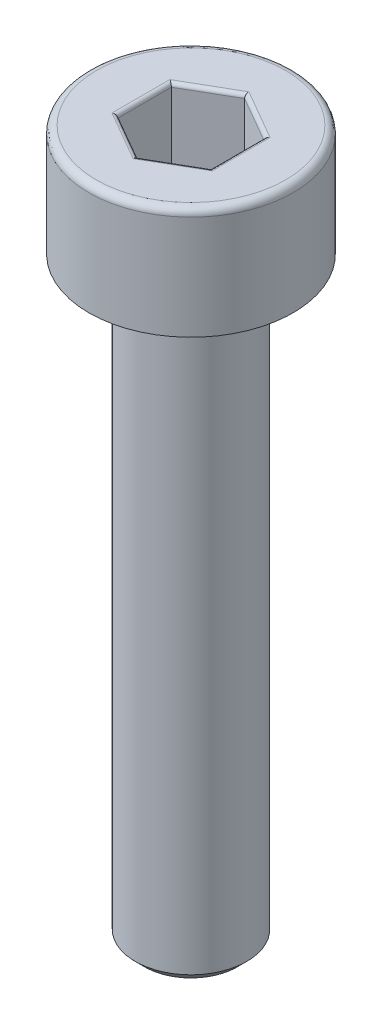
ISO-10303-21;
HEADER;
FILE_DESCRIPTION(('STEP AP214'),'2;1');
FILE_NAME('part.step','',(''),(''),'','','');
FILE_SCHEMA(('AUTOMOTIVE_DESIGN { 1 0 10303 214 1 1 1 1 }'));
ENDSEC;
DATA;
#1=APPLICATION_CONTEXT('core data for automotive mechanical design processes');
#2=APPLICATION_PROTOCOL_DEFINITION('international standard','automotive_design',2000,#1);
#3=PRODUCT_CONTEXT('',#1,'mechanical');
#4=PRODUCT('Part','Part','',(#3));
#5=PRODUCT_RELATED_PRODUCT_CATEGORY('part','',(#4));
#6=PRODUCT_DEFINITION_FORMATION('','',#4);
#7=PRODUCT_DEFINITION_CONTEXT('part definition',#1,'design');
#8=PRODUCT_DEFINITION('design','',#6,#7);
#9=PRODUCT_DEFINITION_SHAPE('','',#8);
#10=(LENGTH_UNIT() NAMED_UNIT(*) SI_UNIT(.MILLI.,.METRE.));
#11=(NAMED_UNIT(*) PLANE_ANGLE_UNIT() SI_UNIT($,.RADIAN.));
#12=(NAMED_UNIT(*) SI_UNIT($,.STERADIAN.) SOLID_ANGLE_UNIT());
#13=UNCERTAINTY_MEASURE_WITH_UNIT(LENGTH_MEASURE(1.E-05),#10,'distance_accuracy_value','');
#14=(GEOMETRIC_REPRESENTATION_CONTEXT(3) GLOBAL_UNCERTAINTY_ASSIGNED_CONTEXT((#13)) GLOBAL_UNIT_ASSIGNED_CONTEXT((#10,
#11,#12)) REPRESENTATION_CONTEXT('',''));
#15=CARTESIAN_POINT('',(0.,0.,0.));
#16=DIRECTION('',(0.,0.,1.));
#17=DIRECTION('',(1.,0.,0.));
#18=AXIS2_PLACEMENT_3D('',#15,#16,#17);
#19=CARTESIAN_POINT('',(0.,-19.,0.));
#20=DIRECTION('',(0.,-1.,0.));
#21=DIRECTION('',(0.,0.,-1.));
#22=AXIS2_PLACEMENT_3D('',#19,#20,#21);
#23=PLANE('',#22);
#24=CARTESIAN_POINT('',(0.,-19.,0.));
#25=DIRECTION('',(0.,-1.,0.));
#26=DIRECTION('',(0.,0.,-1.));
#27=AXIS2_PLACEMENT_3D('',#24,#25,#26);
#28=CIRCLE('',#27,1.25);
#29=CARTESIAN_POINT('',(0.,-19.,-1.25));
#30=VERTEX_POINT('',#29);
#31=EDGE_CURVE('E263',#30,#30,#28,.T.);
#32=ORIENTED_EDGE('',*,*,#31,.T.);
#33=EDGE_LOOP('',(#32));
#34=FACE_BOUND('',#33,.T.);
#35=ADVANCED_FACE('F35',(#34),#23,.T.);
#36=CARTESIAN_POINT('',(0.,0.,0.));
#37=DIRECTION('',(0.,1.,0.));
#38=DIRECTION('',(0.,0.,1.));
#39=AXIS2_PLACEMENT_3D('',#36,#37,#38);
#40=CYLINDRICAL_SURFACE('',#39,1.5);
#41=CARTESIAN_POINT('',(0.,-3.25,0.));
#42=DIRECTION('',(0.,-1.,0.));
#43=DIRECTION('',(0.,0.,-1.));
#44=AXIS2_PLACEMENT_3D('',#41,#42,#43);
#45=CIRCLE('',#44,1.5);
#46=CARTESIAN_POINT('',(0.,-3.25,-1.5));
#47=VERTEX_POINT('',#46);
#48=EDGE_CURVE('E260',#47,#47,#45,.T.);
#49=ORIENTED_EDGE('',*,*,#48,.T.);
#50=EDGE_LOOP('',(#49));
#51=FACE_BOUND('',#50,.T.);
#52=CARTESIAN_POINT('',(0.,-18.75,0.));
#53=DIRECTION('',(0.,-1.,0.));
#54=DIRECTION('',(0.,0.,-1.));
#55=AXIS2_PLACEMENT_3D('',#52,#53,#54);
#56=CIRCLE('',#55,1.5);
#57=CARTESIAN_POINT('',(0.,-18.75,-1.5));
#58=VERTEX_POINT('',#57);
#59=EDGE_CURVE('E257',#58,#58,#56,.F.);
#60=ORIENTED_EDGE('',*,*,#59,.T.);
#61=EDGE_LOOP('',(#60));
#62=FACE_BOUND('',#61,.T.);
#63=ADVANCED_FACE('F289',(#51,#62),#40,.T.);
#64=CARTESIAN_POINT('',(-1.5,-3.,0.));
#65=DIRECTION('',(0.,-1.,0.));
#66=DIRECTION('',(0.,0.,-1.));
#67=AXIS2_PLACEMENT_3D('',#64,#65,#66);
#68=PLANE('',#67);
#69=CARTESIAN_POINT('',(0.,-3.,0.));
#70=DIRECTION('',(0.,-1.,0.));
#71=DIRECTION('',(0.,0.,-1.));
#72=AXIS2_PLACEMENT_3D('',#69,#70,#71);
#73=CIRCLE('',#72,1.75);
#74=CARTESIAN_POINT('',(0.,-3.,-1.75));
#75=VERTEX_POINT('',#74);
#76=EDGE_CURVE('E254',#75,#75,#73,.F.);
#77=ORIENTED_EDGE('',*,*,#76,.T.);
#78=EDGE_LOOP('',(#77));
#79=FACE_BOUND('',#78,.T.);
#80=CARTESIAN_POINT('',(0.,-3.,0.));
#81=DIRECTION('',(0.,1.,0.));
#82=DIRECTION('',(0.,0.,1.));
#83=AXIS2_PLACEMENT_3D('',#80,#81,#82);
#84=CIRCLE('',#83,2.75);
#85=CARTESIAN_POINT('',(0.,-3.,2.75));
#86=VERTEX_POINT('',#85);
#87=EDGE_CURVE('E251',#86,#86,#84,.T.);
#88=ORIENTED_EDGE('',*,*,#87,.F.);
#89=EDGE_LOOP('',(#88));
#90=FACE_BOUND('',#89,.T.);
#91=ADVANCED_FACE('F295',(#79,#90),#68,.T.);
#92=CARTESIAN_POINT('',(0.,0.,0.));
#93=DIRECTION('',(0.,1.,0.));
#94=DIRECTION('',(0.,0.,1.));
#95=AXIS2_PLACEMENT_3D('',#92,#93,#94);
#96=CYLINDRICAL_SURFACE('',#95,2.75);
#97=CARTESIAN_POINT('',(0.,-0.2,0.));
#98=DIRECTION('',(0.,1.,0.));
#99=DIRECTION('',(0.,0.,1.));
#100=AXIS2_PLACEMENT_3D('',#97,#98,#99);
#101=CIRCLE('',#100,2.75);
#102=CARTESIAN_POINT('',(0.,-0.2,2.75));
#103=VERTEX_POINT('',#102);
#104=EDGE_CURVE('E161',#103,#103,#101,.F.);
#105=ORIENTED_EDGE('',*,*,#104,.T.);
#106=EDGE_LOOP('',(#105));
#107=FACE_BOUND('',#106,.T.);
#108=ORIENTED_EDGE('',*,*,#87,.T.);
#109=EDGE_LOOP('',(#108));
#110=FACE_BOUND('',#109,.T.);
#111=ADVANCED_FACE('F305',(#107,#110),#96,.T.);
#112=CARTESIAN_POINT('',(-2.75,0.,0.));
#113=DIRECTION('',(0.,1.,0.));
#114=DIRECTION('',(0.,0.,1.));
#115=AXIS2_PLACEMENT_3D('',#112,#113,#114);
#116=PLANE('',#115);
#117=DIRECTION('',(0.,0.,1.));
#118=VECTOR('',#117,1.);
#119=CARTESIAN_POINT('',(-1.35,0.,-0.721687836487033));
#120=LINE('',#119,#118);
#121=CARTESIAN_POINT('',(-1.35,0.,0.779422863405995));
#122=VERTEX_POINT('',#121);
#123=CARTESIAN_POINT('',(-1.35,0.,-0.779422863405995));
#124=VERTEX_POINT('',#123);
#125=EDGE_CURVE('E177',#122,#124,#120,.F.);
#126=ORIENTED_EDGE('',*,*,#125,.T.);
#127=DIRECTION('',(-0.866025403784439,0.,0.5));
#128=VECTOR('',#127,1.);
#129=CARTESIAN_POINT('',(-0.0500000000000002,0.,-1.52997821335251));
#130=LINE('',#129,#128);
#131=CARTESIAN_POINT('',(0.,0.,-1.55884572681199));
#132=VERTEX_POINT('',#131);
#133=EDGE_CURVE('E136',#124,#132,#130,.F.);
#134=ORIENTED_EDGE('',*,*,#133,.T.);
#135=DIRECTION('',(-0.866025403784439,0.,-0.5));
#136=VECTOR('',#135,1.);
#137=CARTESIAN_POINT('',(1.3,0.,-0.808290376865477));
#138=LINE('',#137,#136);
#139=CARTESIAN_POINT('',(1.35,0.,-0.779422863405995));
#140=VERTEX_POINT('',#139);
#141=EDGE_CURVE('E163',#132,#140,#138,.F.);
#142=ORIENTED_EDGE('',*,*,#141,.T.);
#143=DIRECTION('',(0.,0.,-1.));
#144=VECTOR('',#143,1.);
#145=CARTESIAN_POINT('',(1.35,0.,0.721687836487034));
#146=LINE('',#145,#144);
#147=CARTESIAN_POINT('',(1.35,0.,0.779422863405996));
#148=VERTEX_POINT('',#147);
#149=EDGE_CURVE('E171',#140,#148,#146,.F.);
#150=ORIENTED_EDGE('',*,*,#149,.T.);
#151=DIRECTION('',(0.866025403784439,0.,-0.5));
#152=VECTOR('',#151,1.);
#153=CARTESIAN_POINT('',(0.05,0.,1.52997821335251));
#154=LINE('',#153,#152);
#155=CARTESIAN_POINT('',(0.,0.,1.55884572681199));
#156=VERTEX_POINT('',#155);
#157=EDGE_CURVE('E173',#148,#156,#154,.F.);
#158=ORIENTED_EDGE('',*,*,#157,.T.);
#159=DIRECTION('',(0.866025403784438,0.,0.5));
#160=VECTOR('',#159,1.);
#161=CARTESIAN_POINT('',(-1.3,0.,0.808290376865476));
#162=LINE('',#161,#160);
#163=EDGE_CURVE('E175',#156,#122,#162,.F.);
#164=ORIENTED_EDGE('',*,*,#163,.T.);
#165=EDGE_LOOP('',(#126,#134,#142,#150,#158,#164));
#166=FACE_BOUND('',#165,.T.);
#167=CARTESIAN_POINT('',(0.,0.,0.));
#168=DIRECTION('',(0.,1.,0.));
#169=DIRECTION('',(0.,0.,1.));
#170=AXIS2_PLACEMENT_3D('',#167,#168,#169);
#171=CIRCLE('',#170,2.55);
#172=CARTESIAN_POINT('',(0.,0.,2.55));
#173=VERTEX_POINT('',#172);
#174=EDGE_CURVE('E166',#173,#173,#171,.T.);
#175=ORIENTED_EDGE('',*,*,#174,.T.);
#176=EDGE_LOOP('',(#175));
#177=FACE_BOUND('',#176,.T.);
#178=ADVANCED_FACE('F268',(#166,#177),#116,.T.);
#179=CARTESIAN_POINT('',(0.,-3.,0.));
#180=DIRECTION('',(0.,1.,0.));
#181=DIRECTION('',(0.,0.,1.));
#182=AXIS2_PLACEMENT_3D('',#179,#180,#181);
#183=CONICAL_SURFACE('',#182,1.75,0.785398163397452);
#184=ORIENTED_EDGE('',*,*,#48,.F.);
#185=EDGE_LOOP('',(#184));
#186=FACE_BOUND('',#185,.T.);
#187=ORIENTED_EDGE('',*,*,#76,.F.);
#188=EDGE_LOOP('',(#187));
#189=FACE_BOUND('',#188,.T.);
#190=ADVANCED_FACE('F283',(#186,#189),#183,.T.);
#191=CARTESIAN_POINT('',(0.,-18.75,0.));
#192=DIRECTION('',(0.,1.,0.));
#193=DIRECTION('',(0.,0.,1.));
#194=AXIS2_PLACEMENT_3D('',#191,#192,#193);
#195=CONICAL_SURFACE('',#194,1.5,0.785398163397444);
#196=ORIENTED_EDGE('',*,*,#31,.F.);
#197=EDGE_LOOP('',(#196));
#198=FACE_BOUND('',#197,.T.);
#199=ORIENTED_EDGE('',*,*,#59,.F.);
#200=EDGE_LOOP('',(#199));
#201=FACE_BOUND('',#200,.T.);
#202=ADVANCED_FACE('F273',(#198,#201),#195,.T.);
#203=CARTESIAN_POINT('',(0.,-0.2,0.));
#204=DIRECTION('',(0.,1.,0.));
#205=DIRECTION('',(0.,0.,1.));
#206=AXIS2_PLACEMENT_3D('',#203,#204,#205);
#207=TOROIDAL_SURFACE('',#206,2.55,0.2);
#208=ORIENTED_EDGE('',*,*,#104,.F.);
#209=EDGE_LOOP('',(#208));
#210=FACE_BOUND('',#209,.T.);
#211=ORIENTED_EDGE('',*,*,#174,.F.);
#212=EDGE_LOOP('',(#211));
#213=FACE_BOUND('',#212,.T.);
#214=ADVANCED_FACE('F270',(#210,#213),#207,.T.);
#215=CARTESIAN_POINT('',(1.25,-2.,-0.721687836487033));
#216=DIRECTION('',(0.5,0.,-0.866025403784439));
#217=DIRECTION('',(-0.866025403784439,0.,-0.5));
#218=AXIS2_PLACEMENT_3D('',#215,#216,#217);
#219=PLANE('',#218);
#220=DIRECTION('',(0.,1.,0.));
#221=VECTOR('',#220,1.);
#222=CARTESIAN_POINT('',(1.25,-2.,-0.721687836487033));
#223=LINE('',#222,#221);
#224=CARTESIAN_POINT('',(1.25,-1.9,-0.721687836487033));
#225=VERTEX_POINT('',#224);
#226=CARTESIAN_POINT('',(1.25,-0.1,-0.721687836487033));
#227=VERTEX_POINT('',#226);
#228=EDGE_CURVE('E245',#225,#227,#223,.T.);
#229=ORIENTED_EDGE('',*,*,#228,.T.);
#230=DIRECTION('',(-0.866025403784439,0.,-0.5));
#231=VECTOR('',#230,1.);
#232=CARTESIAN_POINT('',(0.,-0.1,-1.44337567297406));
#233=LINE('',#232,#231);
#234=CARTESIAN_POINT('',(0.,-0.1,-1.44337567297406));
#235=VERTEX_POINT('',#234);
#236=EDGE_CURVE('E197',#227,#235,#233,.T.);
#237=ORIENTED_EDGE('',*,*,#236,.T.);
#238=DIRECTION('',(0.,1.,0.));
#239=VECTOR('',#238,1.);
#240=CARTESIAN_POINT('',(0.,-2.,-1.44337567297406));
#241=LINE('',#240,#239);
#242=CARTESIAN_POINT('',(0.,-1.9,-1.44337567297406));
#243=VERTEX_POINT('',#242);
#244=EDGE_CURVE('E147',#243,#235,#241,.T.);
#245=ORIENTED_EDGE('',*,*,#244,.F.);
#246=DIRECTION('',(-0.866025403784439,0.,-0.5));
#247=VECTOR('',#246,1.);
#248=CARTESIAN_POINT('',(1.25,-1.9,-0.721687836487033));
#249=LINE('',#248,#247);
#250=EDGE_CURVE('E195',#243,#225,#249,.F.);
#251=ORIENTED_EDGE('',*,*,#250,.T.);
#252=EDGE_LOOP('',(#229,#237,#245,#251));
#253=FACE_BOUND('',#252,.T.);
#254=ADVANCED_FACE('F272',(#253),#219,.F.);
#255=CARTESIAN_POINT('',(1.25,-2.,0.721687836487034));
#256=DIRECTION('',(1.,0.,0.));
#257=DIRECTION('',(0.,0.,-1.));
#258=AXIS2_PLACEMENT_3D('',#255,#256,#257);
#259=PLANE('',#258);
#260=DIRECTION('',(0.,1.,0.));
#261=VECTOR('',#260,1.);
#262=CARTESIAN_POINT('',(1.25,-2.,0.721687836487034));
#263=LINE('',#262,#261);
#264=CARTESIAN_POINT('',(1.25,-1.9,0.721687836487034));
#265=VERTEX_POINT('',#264);
#266=CARTESIAN_POINT('',(1.25,-0.1,0.721687836487034));
#267=VERTEX_POINT('',#266);
#268=EDGE_CURVE('E242',#265,#267,#263,.T.);
#269=ORIENTED_EDGE('',*,*,#268,.T.);
#270=DIRECTION('',(0.,0.,-1.));
#271=VECTOR('',#270,1.);
#272=CARTESIAN_POINT('',(1.25,-0.1,-0.721687836487033));
#273=LINE('',#272,#271);
#274=EDGE_CURVE('E193',#267,#227,#273,.T.);
#275=ORIENTED_EDGE('',*,*,#274,.T.);
#276=ORIENTED_EDGE('',*,*,#228,.F.);
#277=DIRECTION('',(0.,0.,-1.));
#278=VECTOR('',#277,1.);
#279=CARTESIAN_POINT('',(1.25,-1.9,0.721687836487034));
#280=LINE('',#279,#278);
#281=EDGE_CURVE('E190',#225,#265,#280,.F.);
#282=ORIENTED_EDGE('',*,*,#281,.T.);
#283=EDGE_LOOP('',(#269,#275,#276,#282));
#284=FACE_BOUND('',#283,.T.);
#285=ADVANCED_FACE('F280',(#284),#259,.F.);
#286=CARTESIAN_POINT('',(0.,-2.,1.44337567297407));
#287=DIRECTION('',(0.5,0.,0.866025403784439));
#288=DIRECTION('',(0.866025403784439,0.,-0.5));
#289=AXIS2_PLACEMENT_3D('',#286,#287,#288);
#290=PLANE('',#289);
#291=DIRECTION('',(0.,1.,0.));
#292=VECTOR('',#291,1.);
#293=CARTESIAN_POINT('',(0.,-2.,1.44337567297407));
#294=LINE('',#293,#292);
#295=CARTESIAN_POINT('',(0.,-1.9,1.44337567297407));
#296=VERTEX_POINT('',#295);
#297=CARTESIAN_POINT('',(0.,-0.1,1.44337567297407));
#298=VERTEX_POINT('',#297);
#299=EDGE_CURVE('E239',#296,#298,#294,.T.);
#300=ORIENTED_EDGE('',*,*,#299,.T.);
#301=DIRECTION('',(0.866025403784439,0.,-0.5));
#302=VECTOR('',#301,1.);
#303=CARTESIAN_POINT('',(1.25,-0.1,0.721687836487034));
#304=LINE('',#303,#302);
#305=EDGE_CURVE('E188',#298,#267,#304,.T.);
#306=ORIENTED_EDGE('',*,*,#305,.T.);
#307=ORIENTED_EDGE('',*,*,#268,.F.);
#308=DIRECTION('',(0.866025403784439,0.,-0.5));
#309=VECTOR('',#308,1.);
#310=CARTESIAN_POINT('',(0.,-1.9,1.44337567297407));
#311=LINE('',#310,#309);
#312=EDGE_CURVE('E186',#265,#296,#311,.F.);
#313=ORIENTED_EDGE('',*,*,#312,.T.);
#314=EDGE_LOOP('',(#300,#306,#307,#313));
#315=FACE_BOUND('',#314,.T.);
#316=ADVANCED_FACE('F329',(#315),#290,.F.);
#317=CARTESIAN_POINT('',(-1.25,-2.,0.721687836487033));
#318=DIRECTION('',(-0.5,0.,0.866025403784439));
#319=DIRECTION('',(0.866025403784438,0.,0.5));
#320=AXIS2_PLACEMENT_3D('',#317,#318,#319);
#321=PLANE('',#320);
#322=DIRECTION('',(0.,1.,0.));
#323=VECTOR('',#322,1.);
#324=CARTESIAN_POINT('',(-1.25,-2.,0.721687836487033));
#325=LINE('',#324,#323);
#326=CARTESIAN_POINT('',(-1.25,-1.9,0.721687836487033));
#327=VERTEX_POINT('',#326);
#328=CARTESIAN_POINT('',(-1.25,-0.1,0.721687836487033));
#329=VERTEX_POINT('',#328);
#330=EDGE_CURVE('E130',#327,#329,#325,.T.);
#331=ORIENTED_EDGE('',*,*,#330,.T.);
#332=DIRECTION('',(0.866025403784438,0.,0.5));
#333=VECTOR('',#332,1.);
#334=CARTESIAN_POINT('',(0.,-0.1,1.44337567297407));
#335=LINE('',#334,#333);
#336=EDGE_CURVE('E184',#329,#298,#335,.T.);
#337=ORIENTED_EDGE('',*,*,#336,.T.);
#338=ORIENTED_EDGE('',*,*,#299,.F.);
#339=DIRECTION('',(0.866025403784438,0.,0.5));
#340=VECTOR('',#339,1.);
#341=CARTESIAN_POINT('',(-1.25,-1.9,0.721687836487033));
#342=LINE('',#341,#340);
#343=EDGE_CURVE('E182',#296,#327,#342,.F.);
#344=ORIENTED_EDGE('',*,*,#343,.T.);
#345=EDGE_LOOP('',(#331,#337,#338,#344));
#346=FACE_BOUND('',#345,.T.);
#347=ADVANCED_FACE('F236',(#346),#321,.F.);
#348=CARTESIAN_POINT('',(-1.25,-2.,-0.721687836487033));
#349=DIRECTION('',(-1.,0.,0.));
#350=DIRECTION('',(0.,0.,1.));
#351=AXIS2_PLACEMENT_3D('',#348,#349,#350);
#352=PLANE('',#351);
#353=DIRECTION('',(0.,1.,0.));
#354=VECTOR('',#353,1.);
#355=CARTESIAN_POINT('',(-1.25,-2.,-0.721687836487033));
#356=LINE('',#355,#354);
#357=CARTESIAN_POINT('',(-1.25,-1.9,-0.721687836487033));
#358=VERTEX_POINT('',#357);
#359=CARTESIAN_POINT('',(-1.25,-0.1,-0.721687836487033));
#360=VERTEX_POINT('',#359);
#361=EDGE_CURVE('E128',#358,#360,#356,.T.);
#362=ORIENTED_EDGE('',*,*,#361,.T.);
#363=DIRECTION('',(0.,0.,1.));
#364=VECTOR('',#363,1.);
#365=CARTESIAN_POINT('',(-1.25,-0.1,0.721687836487033));
#366=LINE('',#365,#364);
#367=EDGE_CURVE('E135',#360,#329,#366,.T.);
#368=ORIENTED_EDGE('',*,*,#367,.T.);
#369=ORIENTED_EDGE('',*,*,#330,.F.);
#370=DIRECTION('',(0.,0.,1.));
#371=VECTOR('',#370,1.);
#372=CARTESIAN_POINT('',(-1.25,-1.9,-0.721687836487033));
#373=LINE('',#372,#371);
#374=EDGE_CURVE('E125',#327,#358,#373,.F.);
#375=ORIENTED_EDGE('',*,*,#374,.T.);
#376=EDGE_LOOP('',(#362,#368,#369,#375));
#377=FACE_BOUND('',#376,.T.);
#378=ADVANCED_FACE('F127',(#377),#352,.F.);
#379=CARTESIAN_POINT('',(0.,-2.,-1.44337567297406));
#380=DIRECTION('',(-0.5,0.,-0.866025403784439));
#381=DIRECTION('',(-0.866025403784439,0.,0.5));
#382=AXIS2_PLACEMENT_3D('',#379,#380,#381);
#383=PLANE('',#382);
#384=ORIENTED_EDGE('',*,*,#244,.T.);
#385=DIRECTION('',(-0.866025403784439,0.,0.5));
#386=VECTOR('',#385,1.);
#387=CARTESIAN_POINT('',(-1.25,-0.1,-0.721687836487032));
#388=LINE('',#387,#386);
#389=EDGE_CURVE('E146',#235,#360,#388,.T.);
#390=ORIENTED_EDGE('',*,*,#389,.T.);
#391=ORIENTED_EDGE('',*,*,#361,.F.);
#392=DIRECTION('',(-0.866025403784439,0.,0.5));
#393=VECTOR('',#392,1.);
#394=CARTESIAN_POINT('',(0.,-1.9,-1.44337567297406));
#395=LINE('',#394,#393);
#396=EDGE_CURVE('E143',#358,#243,#395,.F.);
#397=ORIENTED_EDGE('',*,*,#396,.T.);
#398=EDGE_LOOP('',(#384,#390,#391,#397));
#399=FACE_BOUND('',#398,.T.);
#400=ADVANCED_FACE('F141',(#399),#383,.F.);
#401=CARTESIAN_POINT('',(1.25,-2.,-0.721687836487033));
#402=DIRECTION('',(0.,-1.,0.));
#403=DIRECTION('',(0.,0.,-1.));
#404=AXIS2_PLACEMENT_3D('',#401,#402,#403);
#405=PLANE('',#404);
#406=DIRECTION('',(0.866025403784439,0.,-0.5));
#407=VECTOR('',#406,1.);
#408=CARTESIAN_POINT('',(1.2,-2.,0.63508529610859));
#409=LINE('',#408,#407);
#410=CARTESIAN_POINT('',(0.,-2.,1.32790561913614));
#411=VERTEX_POINT('',#410);
#412=CARTESIAN_POINT('',(1.15,-2.,0.663952809568071));
#413=VERTEX_POINT('',#412);
#414=EDGE_CURVE('E44',#411,#413,#409,.T.);
#415=ORIENTED_EDGE('',*,*,#414,.T.);
#416=DIRECTION('',(0.,0.,-1.));
#417=VECTOR('',#416,1.);
#418=CARTESIAN_POINT('',(1.15,-2.,-0.721687836487033));
#419=LINE('',#418,#417);
#420=CARTESIAN_POINT('',(1.15,-2.,-0.66395280956807));
#421=VERTEX_POINT('',#420);
#422=EDGE_CURVE('E11',#413,#421,#419,.T.);
#423=ORIENTED_EDGE('',*,*,#422,.T.);
#424=DIRECTION('',(-0.866025403784439,0.,-0.5));
#425=VECTOR('',#424,1.);
#426=CARTESIAN_POINT('',(-0.0500000000000001,-2.,-1.35677313259562));
#427=LINE('',#426,#425);
#428=CARTESIAN_POINT('',(0.,-2.,-1.32790561913614));
#429=VERTEX_POINT('',#428);
#430=EDGE_CURVE('E199',#421,#429,#427,.T.);
#431=ORIENTED_EDGE('',*,*,#430,.T.);
#432=DIRECTION('',(-0.866025403784439,0.,0.5));
#433=VECTOR('',#432,1.);
#434=CARTESIAN_POINT('',(-1.2,-2.,-0.635085296108588));
#435=LINE('',#434,#433);
#436=CARTESIAN_POINT('',(-1.15,-2.,-0.66395280956807));
#437=VERTEX_POINT('',#436);
#438=EDGE_CURVE('E201',#429,#437,#435,.T.);
#439=ORIENTED_EDGE('',*,*,#438,.T.);
#440=DIRECTION('',(0.,0.,1.));
#441=VECTOR('',#440,1.);
#442=CARTESIAN_POINT('',(-1.15,-2.,0.721687836487033));
#443=LINE('',#442,#441);
#444=CARTESIAN_POINT('',(-1.15,-2.,0.66395280956807));
#445=VERTEX_POINT('',#444);
#446=EDGE_CURVE('E152',#437,#445,#443,.T.);
#447=ORIENTED_EDGE('',*,*,#446,.T.);
#448=DIRECTION('',(0.866025403784438,0.,0.5));
#449=VECTOR('',#448,1.);
#450=CARTESIAN_POINT('',(0.0499999999999999,-2.,1.35677313259562));
#451=LINE('',#450,#449);
#452=EDGE_CURVE('E55',#445,#411,#451,.T.);
#453=ORIENTED_EDGE('',*,*,#452,.T.);
#454=EDGE_LOOP('',(#415,#423,#431,#439,#447,#453));
#455=FACE_BOUND('',#454,.T.);
#456=ADVANCED_FACE('F324',(#455),#405,.F.);
#457=CARTESIAN_POINT('',(0.05,-0.1,1.52997821335251));
#458=DIRECTION('',(-0.866025403784439,0.,0.5));
#459=DIRECTION('',(0.5,0.,0.866025403784439));
#460=AXIS2_PLACEMENT_3D('',#457,#458,#459);
#461=CYLINDRICAL_SURFACE('',#460,0.1);
#462=CARTESIAN_POINT('',(0.,-0.1,1.55884572681199));
#463=DIRECTION('',(-1.,0.,0.));
#464=DIRECTION('',(0.,0.,-1.));
#465=AXIS2_PLACEMENT_3D('',#462,#463,#464);
#466=ELLIPSE('',#465,0.115470053837925,0.1);
#467=EDGE_CURVE('E216',#156,#298,#466,.T.);
#468=ORIENTED_EDGE('',*,*,#467,.F.);
#469=ORIENTED_EDGE('',*,*,#157,.F.);
#470=CARTESIAN_POINT('',(1.35,-0.1,0.779422863405997));
#471=DIRECTION('',(-0.5,0.,0.866025403784438));
#472=DIRECTION('',(-0.866025403784438,0.,-0.5));
#473=AXIS2_PLACEMENT_3D('',#470,#471,#472);
#474=ELLIPSE('',#473,0.115470053837925,0.1);
#475=EDGE_CURVE('E219',#267,#148,#474,.F.);
#476=ORIENTED_EDGE('',*,*,#475,.F.);
#477=ORIENTED_EDGE('',*,*,#305,.F.);
#478=EDGE_LOOP('',(#468,#469,#476,#477));
#479=FACE_BOUND('',#478,.T.);
#480=ADVANCED_FACE('F336',(#479),#461,.T.);
#481=CARTESIAN_POINT('',(1.35,-0.1,0.721687836487034));
#482=DIRECTION('',(0.,0.,1.));
#483=DIRECTION('',(1.,0.,0.));
#484=AXIS2_PLACEMENT_3D('',#481,#482,#483);
#485=CYLINDRICAL_SURFACE('',#484,0.1);
#486=ORIENTED_EDGE('',*,*,#475,.T.);
#487=ORIENTED_EDGE('',*,*,#149,.F.);
#488=CARTESIAN_POINT('',(1.35,-0.1,-0.779422863405995));
#489=DIRECTION('',(0.5,0.,0.866025403784439));
#490=DIRECTION('',(-0.866025403784439,0.,0.5));
#491=AXIS2_PLACEMENT_3D('',#488,#489,#490);
#492=ELLIPSE('',#491,0.115470053837925,0.1);
#493=EDGE_CURVE('E213',#227,#140,#492,.F.);
#494=ORIENTED_EDGE('',*,*,#493,.F.);
#495=ORIENTED_EDGE('',*,*,#274,.F.);
#496=EDGE_LOOP('',(#486,#487,#494,#495));
#497=FACE_BOUND('',#496,.T.);
#498=ADVANCED_FACE('F340',(#497),#485,.T.);
#499=CARTESIAN_POINT('',(-1.3,-0.1,0.808290376865476));
#500=DIRECTION('',(-0.866025403784438,0.,-0.5));
#501=DIRECTION('',(-0.5,0.,0.866025403784439));
#502=AXIS2_PLACEMENT_3D('',#499,#500,#501);
#503=CYLINDRICAL_SURFACE('',#502,0.1);
#504=ORIENTED_EDGE('',*,*,#467,.T.);
#505=ORIENTED_EDGE('',*,*,#336,.F.);
#506=CARTESIAN_POINT('',(-1.35,-0.1,0.779422863405995));
#507=DIRECTION('',(-0.5,0.,-0.866025403784439));
#508=DIRECTION('',(0.866025403784439,0.,-0.5));
#509=AXIS2_PLACEMENT_3D('',#506,#507,#508);
#510=ELLIPSE('',#509,0.115470053837925,0.1);
#511=EDGE_CURVE('E210',#122,#329,#510,.T.);
#512=ORIENTED_EDGE('',*,*,#511,.F.);
#513=ORIENTED_EDGE('',*,*,#163,.F.);
#514=EDGE_LOOP('',(#504,#505,#512,#513));
#515=FACE_BOUND('',#514,.T.);
#516=ADVANCED_FACE('F346',(#515),#503,.T.);
#517=CARTESIAN_POINT('',(1.3,-0.1,-0.808290376865477));
#518=DIRECTION('',(0.866025403784439,0.,0.5));
#519=DIRECTION('',(0.5,0.,-0.866025403784439));
#520=AXIS2_PLACEMENT_3D('',#517,#518,#519);
#521=CYLINDRICAL_SURFACE('',#520,0.1);
#522=ORIENTED_EDGE('',*,*,#493,.T.);
#523=ORIENTED_EDGE('',*,*,#141,.F.);
#524=CARTESIAN_POINT('',(0.,-0.1,-1.55884572681199));
#525=DIRECTION('',(1.,0.,0.));
#526=DIRECTION('',(0.,0.,-1.));
#527=AXIS2_PLACEMENT_3D('',#524,#525,#526);
#528=ELLIPSE('',#527,0.115470053837925,0.1);
#529=EDGE_CURVE('E208',#235,#132,#528,.F.);
#530=ORIENTED_EDGE('',*,*,#529,.F.);
#531=ORIENTED_EDGE('',*,*,#236,.F.);
#532=EDGE_LOOP('',(#522,#523,#530,#531));
#533=FACE_BOUND('',#532,.T.);
#534=ADVANCED_FACE('F376',(#533),#521,.T.);
#535=CARTESIAN_POINT('',(-1.35,-0.1,-0.721687836487033));
#536=DIRECTION('',(0.,0.,-1.));
#537=DIRECTION('',(-1.,0.,0.));
#538=AXIS2_PLACEMENT_3D('',#535,#536,#537);
#539=CYLINDRICAL_SURFACE('',#538,0.1);
#540=ORIENTED_EDGE('',*,*,#511,.T.);
#541=ORIENTED_EDGE('',*,*,#367,.F.);
#542=CARTESIAN_POINT('',(-1.35,-0.1,-0.779422863405995));
#543=DIRECTION('',(0.5,0.,-0.866025403784439));
#544=DIRECTION('',(0.866025403784439,0.,0.5));
#545=AXIS2_PLACEMENT_3D('',#542,#543,#544);
#546=ELLIPSE('',#545,0.115470053837925,0.1);
#547=EDGE_CURVE('E206',#124,#360,#546,.T.);
#548=ORIENTED_EDGE('',*,*,#547,.F.);
#549=ORIENTED_EDGE('',*,*,#125,.F.);
#550=EDGE_LOOP('',(#540,#541,#548,#549));
#551=FACE_BOUND('',#550,.T.);
#552=ADVANCED_FACE('F371',(#551),#539,.T.);
#553=CARTESIAN_POINT('',(-0.05,-0.1,-1.52997821335251));
#554=DIRECTION('',(0.866025403784439,0.,-0.5));
#555=DIRECTION('',(-0.5,0.,-0.866025403784439));
#556=AXIS2_PLACEMENT_3D('',#553,#554,#555);
#557=CYLINDRICAL_SURFACE('',#556,0.1);
#558=ORIENTED_EDGE('',*,*,#529,.T.);
#559=ORIENTED_EDGE('',*,*,#133,.F.);
#560=ORIENTED_EDGE('',*,*,#547,.T.);
#561=ORIENTED_EDGE('',*,*,#389,.F.);
#562=EDGE_LOOP('',(#558,#559,#560,#561));
#563=FACE_BOUND('',#562,.T.);
#564=ADVANCED_FACE('F367',(#563),#557,.T.);
#565=CARTESIAN_POINT('',(-1.15,-1.9,-0.721687836487033));
#566=DIRECTION('',(0.,0.,-1.));
#567=DIRECTION('',(-1.,0.,0.));
#568=AXIS2_PLACEMENT_3D('',#565,#566,#567);
#569=CYLINDRICAL_SURFACE('',#568,0.1);
#570=CARTESIAN_POINT('',(-1.15,-1.9,-0.663952809568069));
#571=DIRECTION('',(0.5,0.,-0.866025403784439));
#572=DIRECTION('',(-0.866025403784439,0.,-0.5));
#573=AXIS2_PLACEMENT_3D('',#570,#571,#572);
#574=ELLIPSE('',#573,0.115470053837925,0.1);
#575=EDGE_CURVE('E151',#358,#437,#574,.F.);
#576=ORIENTED_EDGE('',*,*,#575,.F.);
#577=ORIENTED_EDGE('',*,*,#374,.F.);
#578=CARTESIAN_POINT('',(-1.15,-1.9,0.66395280956807));
#579=DIRECTION('',(-0.5,0.,-0.866025403784439));
#580=DIRECTION('',(-0.866025403784439,0.,0.5));
#581=AXIS2_PLACEMENT_3D('',#578,#579,#580);
#582=ELLIPSE('',#581,0.115470053837925,0.1);
#583=EDGE_CURVE('E39',#445,#327,#582,.T.);
#584=ORIENTED_EDGE('',*,*,#583,.F.);
#585=ORIENTED_EDGE('',*,*,#446,.F.);
#586=EDGE_LOOP('',(#576,#577,#584,#585));
#587=FACE_BOUND('',#586,.T.);
#588=ADVANCED_FACE('F37',(#587),#569,.F.);
#589=CARTESIAN_POINT('',(0.0499999999999988,-1.9,1.35677313259562));
#590=DIRECTION('',(-0.866025403784438,0.,-0.5));
#591=DIRECTION('',(-0.5,0.,0.866025403784439));
#592=AXIS2_PLACEMENT_3D('',#589,#590,#591);
#593=CYLINDRICAL_SURFACE('',#592,0.1);
#594=ORIENTED_EDGE('',*,*,#583,.T.);
#595=ORIENTED_EDGE('',*,*,#343,.F.);
#596=CARTESIAN_POINT('',(0.,-1.9,1.32790561913614));
#597=DIRECTION('',(-1.,0.,0.));
#598=DIRECTION('',(0.,0.,1.));
#599=AXIS2_PLACEMENT_3D('',#596,#597,#598);
#600=ELLIPSE('',#599,0.115470053837925,0.1);
#601=EDGE_CURVE('E155',#411,#296,#600,.T.);
#602=ORIENTED_EDGE('',*,*,#601,.F.);
#603=ORIENTED_EDGE('',*,*,#452,.F.);
#604=EDGE_LOOP('',(#594,#595,#602,#603));
#605=FACE_BOUND('',#604,.T.);
#606=ADVANCED_FACE('F233',(#605),#593,.F.);
#607=CARTESIAN_POINT('',(0.675,-1.9,-1.71761705083914));
#608=DIRECTION('',(0.866025403784439,0.,-0.5));
#609=DIRECTION('',(-0.5,0.,-0.866025403784439));
#610=AXIS2_PLACEMENT_3D('',#607,#608,#609);
#611=CYLINDRICAL_SURFACE('',#610,0.1);
#612=ORIENTED_EDGE('',*,*,#575,.T.);
#613=ORIENTED_EDGE('',*,*,#438,.F.);
#614=CARTESIAN_POINT('',(0.,-1.9,-1.32790561913614));
#615=DIRECTION('',(1.,0.,0.));
#616=DIRECTION('',(0.,0.,-1.));
#617=AXIS2_PLACEMENT_3D('',#614,#615,#616);
#618=ELLIPSE('',#617,0.115470053837925,0.1);
#619=EDGE_CURVE('E159',#243,#429,#618,.F.);
#620=ORIENTED_EDGE('',*,*,#619,.F.);
#621=ORIENTED_EDGE('',*,*,#396,.F.);
#622=EDGE_LOOP('',(#612,#613,#620,#621));
#623=FACE_BOUND('',#622,.T.);
#624=ADVANCED_FACE('F157',(#623),#611,.F.);
#625=CARTESIAN_POINT('',(1.825,-1.9,0.274241377865074));
#626=DIRECTION('',(-0.866025403784439,0.,0.5));
#627=DIRECTION('',(0.5,0.,0.866025403784439));
#628=AXIS2_PLACEMENT_3D('',#625,#626,#627);
#629=CYLINDRICAL_SURFACE('',#628,0.1);
#630=ORIENTED_EDGE('',*,*,#601,.T.);
#631=ORIENTED_EDGE('',*,*,#312,.F.);
#632=CARTESIAN_POINT('',(1.15,-1.9,0.663952809568072));
#633=DIRECTION('',(-0.5,0.,0.866025403784438));
#634=DIRECTION('',(0.866025403784438,0.,0.5));
#635=AXIS2_PLACEMENT_3D('',#632,#633,#634);
#636=ELLIPSE('',#635,0.115470053837925,0.1);
#637=EDGE_CURVE('E224',#413,#265,#636,.T.);
#638=ORIENTED_EDGE('',*,*,#637,.F.);
#639=ORIENTED_EDGE('',*,*,#414,.F.);
#640=EDGE_LOOP('',(#630,#631,#638,#639));
#641=FACE_BOUND('',#640,.T.);
#642=ADVANCED_FACE('F230',(#641),#629,.F.);
#643=CARTESIAN_POINT('',(1.2,-1.9,-0.635085296108589));
#644=DIRECTION('',(0.866025403784439,0.,0.5));
#645=DIRECTION('',(0.5,0.,-0.866025403784439));
#646=AXIS2_PLACEMENT_3D('',#643,#644,#645);
#647=CYLINDRICAL_SURFACE('',#646,0.1);
#648=ORIENTED_EDGE('',*,*,#619,.T.);
#649=ORIENTED_EDGE('',*,*,#430,.F.);
#650=CARTESIAN_POINT('',(1.15,-1.9,-0.66395280956807));
#651=DIRECTION('',(0.5,0.,0.866025403784439));
#652=DIRECTION('',(-0.866025403784439,0.,0.5));
#653=AXIS2_PLACEMENT_3D('',#650,#651,#652);
#654=ELLIPSE('',#653,0.115470053837925,0.1);
#655=EDGE_CURVE('E222',#225,#421,#654,.F.);
#656=ORIENTED_EDGE('',*,*,#655,.F.);
#657=ORIENTED_EDGE('',*,*,#250,.F.);
#658=EDGE_LOOP('',(#648,#649,#656,#657));
#659=FACE_BOUND('',#658,.T.);
#660=ADVANCED_FACE('F355',(#659),#647,.F.);
#661=CARTESIAN_POINT('',(1.15,-1.9,-0.721687836487033));
#662=DIRECTION('',(0.,0.,1.));
#663=DIRECTION('',(1.,0.,0.));
#664=AXIS2_PLACEMENT_3D('',#661,#662,#663);
#665=CYLINDRICAL_SURFACE('',#664,0.1);
#666=ORIENTED_EDGE('',*,*,#637,.T.);
#667=ORIENTED_EDGE('',*,*,#281,.F.);
#668=ORIENTED_EDGE('',*,*,#655,.T.);
#669=ORIENTED_EDGE('',*,*,#422,.F.);
#670=EDGE_LOOP('',(#666,#667,#668,#669));
#671=FACE_BOUND('',#670,.T.);
#672=ADVANCED_FACE('F352',(#671),#665,.F.);
#673=CLOSED_SHELL('',(#35,#63,#91,#111,#178,#190,#202,#214,#254,#285,#316,#347,#378,#400,#456,
#480,#498,#516,#534,#552,#564,#588,#606,#624,#642,#660,#672));
#674=MANIFOLD_SOLID_BREP('B2',#673);
#675=ADVANCED_BREP_SHAPE_REPRESENTATION('',(#18,#674),#14);
#676=SHAPE_DEFINITION_REPRESENTATION(#9,#675);
ENDSEC;
END-ISO-10303-21;
